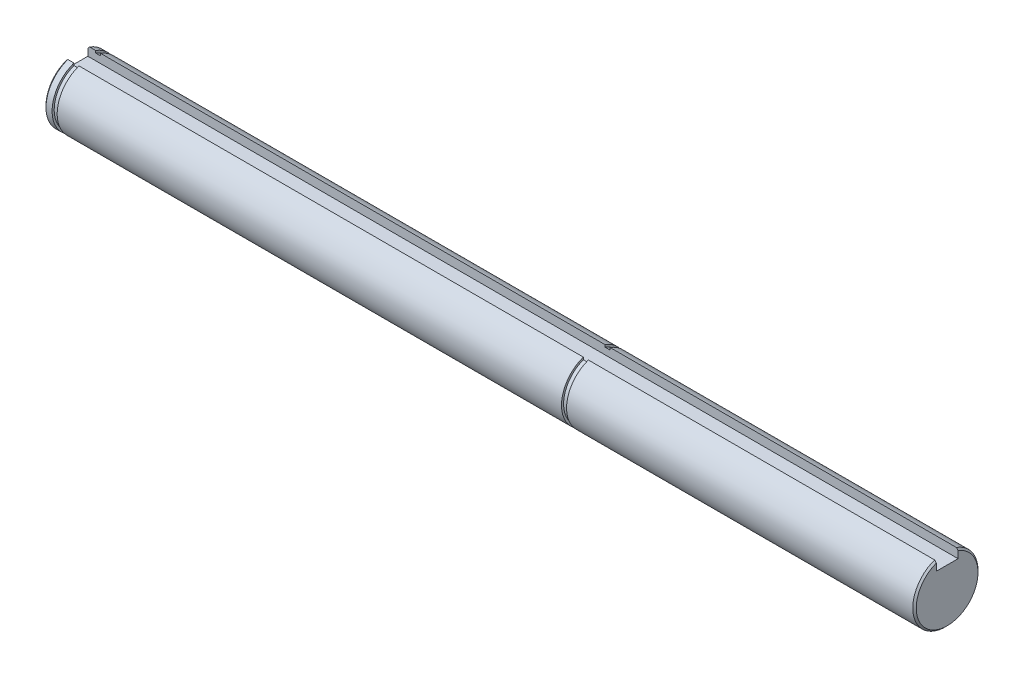
ISO-10303-21;
HEADER;
FILE_DESCRIPTION(('STEP AP214'),'2;1');
FILE_NAME('part.step','',(''),(''),'','','');
FILE_SCHEMA(('AUTOMOTIVE_DESIGN { 1 0 10303 214 1 1 1 1 }'));
ENDSEC;
DATA;
#1=APPLICATION_CONTEXT('core data for automotive mechanical design processes');
#2=APPLICATION_PROTOCOL_DEFINITION('international standard','automotive_design',2000,#1);
#3=PRODUCT_CONTEXT('',#1,'mechanical');
#4=PRODUCT('Part','Part','',(#3));
#5=PRODUCT_RELATED_PRODUCT_CATEGORY('part','',(#4));
#6=PRODUCT_DEFINITION_FORMATION('','',#4);
#7=PRODUCT_DEFINITION_CONTEXT('part definition',#1,'design');
#8=PRODUCT_DEFINITION('design','',#6,#7);
#9=PRODUCT_DEFINITION_SHAPE('','',#8);
#10=(LENGTH_UNIT() NAMED_UNIT(*) SI_UNIT(.MILLI.,.METRE.));
#11=(NAMED_UNIT(*) PLANE_ANGLE_UNIT() SI_UNIT($,.RADIAN.));
#12=(NAMED_UNIT(*) SI_UNIT($,.STERADIAN.) SOLID_ANGLE_UNIT());
#13=UNCERTAINTY_MEASURE_WITH_UNIT(LENGTH_MEASURE(1.E-05),#10,'distance_accuracy_value','');
#14=(GEOMETRIC_REPRESENTATION_CONTEXT(3) GLOBAL_UNCERTAINTY_ASSIGNED_CONTEXT((#13)) GLOBAL_UNIT_ASSIGNED_CONTEXT((#10,
#11,#12)) REPRESENTATION_CONTEXT('',''));
#15=CARTESIAN_POINT('',(0.,0.,0.));
#16=DIRECTION('',(0.,0.,1.));
#17=DIRECTION('',(1.,0.,0.));
#18=AXIS2_PLACEMENT_3D('',#15,#16,#17);
#19=CARTESIAN_POINT('',(659.91194030579,356.657354756465,0.));
#20=DIRECTION('',(1.,0.,0.));
#21=DIRECTION('',(0.,0.,-1.));
#22=AXIS2_PLACEMENT_3D('',#19,#20,#21);
#23=CONICAL_SURFACE('',#22,4.76249999979939,0.785398162502276);
#24=CARTESIAN_POINT('',(659.911940305865,361.151952759526,1.57480000003161));
#25=CARTESIAN_POINT('',(659.869526596549,361.107015509651,1.57480000001581));
#26=CARTESIAN_POINT('',(659.827153075668,361.062040463665,1.57480000000527));
#27=CARTESIAN_POINT('',(659.742486408928,360.972014777503,1.57479999999473));
#28=CARTESIAN_POINT('',(659.700193263073,360.926964137324,1.57479999999473));
#29=CARTESIAN_POINT('',(659.657940305656,360.881875701031,1.5748));
#30=B_SPLINE_CURVE_WITH_KNOTS('',3,(#24,#25,#26,#27,#28,#29),.UNSPECIFIED.,.F.,.F.,(4,2,4),(0.,
0.18537645562414,0.370752919345661),.UNSPECIFIED.);
#31=CARTESIAN_POINT('',(659.911940305823,361.151952759566,1.57479999999999));
#32=VERTEX_POINT('',#31);
#33=CARTESIAN_POINT('',(659.657940305674,360.881875701051,1.5748));
#34=VERTEX_POINT('',#33);
#35=EDGE_CURVE('E126',#32,#34,#30,.T.);
#36=ORIENTED_EDGE('',*,*,#35,.T.);
#37=CARTESIAN_POINT('',(659.657940305692,356.657354756465,0.));
#38=DIRECTION('',(1.,0.,0.));
#39=DIRECTION('',(0.,0.,-1.));
#40=AXIS2_PLACEMENT_3D('',#37,#38,#39);
#41=CIRCLE('',#40,4.50850000015646);
#42=CARTESIAN_POINT('',(659.657940305674,360.872320024559,-1.6002));
#43=VERTEX_POINT('',#42);
#44=EDGE_CURVE('E128',#43,#34,#41,.F.);
#45=ORIENTED_EDGE('',*,*,#44,.F.);
#46=CARTESIAN_POINT('',(659.657940305671,360.872320024525,-1.6001999999729));
#47=CARTESIAN_POINT('',(659.700190128658,360.917507138496,-1.60019999998645));
#48=CARTESIAN_POINT('',(659.742481707333,360.96265506588,-1.60019999999548));
#49=CARTESIAN_POINT('',(659.827148374075,361.052872545361,-1.60020000000452));
#50=CARTESIAN_POINT('',(659.869523462136,361.09794209746,-1.60020000000452));
#51=CARTESIAN_POINT('',(659.911940305883,361.142972462977,-1.6002));
#52=B_SPLINE_CURVE_WITH_KNOTS('',3,(#46,#47,#48,#49,#50,#51),.UNSPECIFIED.,.F.,.F.,(4,2,4),(0.,
0.185586143788459,0.371172278862949),.UNSPECIFIED.);
#53=CARTESIAN_POINT('',(659.911940305877,361.142972463091,-1.6002));
#54=VERTEX_POINT('',#53);
#55=EDGE_CURVE('E21',#43,#54,#52,.T.);
#56=ORIENTED_EDGE('',*,*,#55,.T.);
#57=CARTESIAN_POINT('',(659.911940305764,356.657354756465,0.));
#58=DIRECTION('',(1.,0.,0.));
#59=DIRECTION('',(0.,0.,-1.));
#60=AXIS2_PLACEMENT_3D('',#57,#58,#59);
#61=CIRCLE('',#60,4.7625);
#62=EDGE_CURVE('E164',#32,#54,#61,.T.);
#63=ORIENTED_EDGE('',*,*,#62,.F.);
#64=EDGE_LOOP('',(#36,#45,#56,#63));
#65=FACE_BOUND('',#64,.T.);
#66=ADVANCED_FACE('F17',(#65),#23,.T.);
#67=CARTESIAN_POINT('',(660.229440305764,356.657354756465,0.));
#68=DIRECTION('',(1.,0.,0.));
#69=DIRECTION('',(0.,0.,-1.));
#70=AXIS2_PLACEMENT_3D('',#67,#68,#69);
#71=CYLINDRICAL_SURFACE('',#70,4.7625);
#72=DIRECTION('',(1.,0.,0.));
#73=VECTOR('',#72,1.);
#74=CARTESIAN_POINT('',(660.229440305764,361.151952759623,1.57479999999998));
#75=LINE('',#74,#73);
#76=CARTESIAN_POINT('',(660.800940305764,361.151952759623,1.5748));
#77=VERTEX_POINT('',#76);
#78=EDGE_CURVE('E161',#77,#32,#75,.F.);
#79=ORIENTED_EDGE('',*,*,#78,.T.);
#80=ORIENTED_EDGE('',*,*,#62,.T.);
#81=DIRECTION('',(1.,0.,0.));
#82=VECTOR('',#81,1.);
#83=CARTESIAN_POINT('',(660.229440305764,361.142972463091,-1.6002));
#84=LINE('',#83,#82);
#85=CARTESIAN_POINT('',(660.800940305764,361.142972463091,-1.6002));
#86=VERTEX_POINT('',#85);
#87=EDGE_CURVE('E122',#54,#86,#84,.T.);
#88=ORIENTED_EDGE('',*,*,#87,.T.);
#89=CARTESIAN_POINT('',(660.800940305764,356.657354756465,0.));
#90=DIRECTION('',(1.,0.,0.));
#91=DIRECTION('',(0.,0.,-1.));
#92=AXIS2_PLACEMENT_3D('',#89,#90,#91);
#93=CIRCLE('',#92,4.7625);
#94=EDGE_CURVE('E209',#77,#86,#93,.T.);
#95=ORIENTED_EDGE('',*,*,#94,.F.);
#96=EDGE_LOOP('',(#79,#80,#88,#95));
#97=FACE_BOUND('',#96,.T.);
#98=ADVANCED_FACE('F236',(#97),#71,.T.);
#99=CARTESIAN_POINT('',(786.454740305714,356.657354756465,0.));
#100=DIRECTION('',(-1.,0.,0.));
#101=DIRECTION('',(0.,0.,1.));
#102=AXIS2_PLACEMENT_3D('',#99,#100,#101);
#103=CONICAL_SURFACE('',#102,4.76249999979939,0.78539816239038);
#104=CARTESIAN_POINT('',(786.708740305873,360.881875701034,1.57479999997262));
#105=CARTESIAN_POINT('',(786.666487348461,360.926964137334,1.57479999998631));
#106=CARTESIAN_POINT('',(786.624194202605,360.972014777513,1.57479999999544));
#107=CARTESIAN_POINT('',(786.539527535853,361.062040463666,1.57480000000456));
#108=CARTESIAN_POINT('',(786.49715401496,361.107015509643,1.57480000000456));
#109=CARTESIAN_POINT('',(786.454740305627,361.151952759503,1.5748));
#110=B_SPLINE_CURVE_WITH_KNOTS('',3,(#104,#105,#106,#107,#108,#109),.UNSPECIFIED.,.F.,.F.,(4,2,
4),(0.,0.185376463724679,0.370752919352015),.UNSPECIFIED.);
#111=CARTESIAN_POINT('',(786.708740305879,360.88187570106,1.5748));
#112=VERTEX_POINT('',#111);
#113=CARTESIAN_POINT('',(786.454740305696,361.151952759563,1.5748));
#114=VERTEX_POINT('',#113);
#115=EDGE_CURVE('E149',#112,#114,#110,.T.);
#116=ORIENTED_EDGE('',*,*,#115,.T.);
#117=CARTESIAN_POINT('',(786.454740305764,356.657354756465,0.));
#118=DIRECTION('',(1.,0.,0.));
#119=DIRECTION('',(0.,0.,-1.));
#120=AXIS2_PLACEMENT_3D('',#117,#118,#119);
#121=CIRCLE('',#120,4.7625);
#122=CARTESIAN_POINT('',(786.454740305696,361.142972463031,-1.6002));
#123=VERTEX_POINT('',#122);
#124=EDGE_CURVE('E186',#123,#114,#121,.F.);
#125=ORIENTED_EDGE('',*,*,#124,.F.);
#126=CARTESIAN_POINT('',(786.454740305653,361.142972462995,-1.6002000000453));
#127=CARTESIAN_POINT('',(786.49715714939,361.097942097468,-1.60020000002265));
#128=CARTESIAN_POINT('',(786.539532237448,361.052872545364,-1.60020000000755));
#129=CARTESIAN_POINT('',(786.624198904198,360.962655065889,-1.60019999999245));
#130=CARTESIAN_POINT('',(786.666490482884,360.917507138513,-1.60019999999245));
#131=CARTESIAN_POINT('',(786.708740305889,360.872320024557,-1.6002));
#132=B_SPLINE_CURVE_WITH_KNOTS('',3,(#126,#127,#128,#129,#130,#131),.UNSPECIFIED.,.F.,.F.,(4,2,
4),(0.,0.185586135077501,0.371172278869036),.UNSPECIFIED.);
#133=CARTESIAN_POINT('',(786.708740305827,360.872320024624,-1.6002));
#134=VERTEX_POINT('',#133);
#135=EDGE_CURVE('E190',#123,#134,#132,.T.);
#136=ORIENTED_EDGE('',*,*,#135,.T.);
#137=CARTESIAN_POINT('',(786.708740305869,356.657354756465,0.));
#138=DIRECTION('',(-1.,0.,0.));
#139=DIRECTION('',(0.,0.,1.));
#140=AXIS2_PLACEMENT_3D('',#137,#138,#139);
#141=CIRCLE('',#140,4.50850000015646);
#142=EDGE_CURVE('E213',#112,#134,#141,.F.);
#143=ORIENTED_EDGE('',*,*,#142,.F.);
#144=EDGE_LOOP('',(#116,#125,#136,#143));
#145=FACE_BOUND('',#144,.T.);
#146=ADVANCED_FACE('F231',(#145),#103,.T.);
#147=CARTESIAN_POINT('',(735.908740305764,361.267454756465,0.));
#148=DIRECTION('',(-1.,0.,0.));
#149=DIRECTION('',(0.,0.,1.));
#150=AXIS2_PLACEMENT_3D('',#147,#148,#149);
#151=PLANE('',#150);
#152=DIRECTION('',(0.,1.,0.));
#153=VECTOR('',#152,1.);
#154=CARTESIAN_POINT('',(735.908740305764,361.267454756465,1.5748));
#155=LINE('',#154,#153);
#156=CARTESIAN_POINT('',(735.908740305764,361.151952759623,1.5748));
#157=VERTEX_POINT('',#156);
#158=CARTESIAN_POINT('',(735.908740305764,360.827617847686,1.5748));
#159=VERTEX_POINT('',#158);
#160=EDGE_CURVE('E138',#157,#159,#155,.F.);
#161=ORIENTED_EDGE('',*,*,#160,.T.);
#162=CARTESIAN_POINT('',(735.908740305764,356.657354756465,0.));
#163=DIRECTION('',(1.,0.,0.));
#164=DIRECTION('',(0.,0.,-1.));
#165=AXIS2_PLACEMENT_3D('',#162,#163,#164);
#166=CIRCLE('',#165,4.45770000000003);
#167=CARTESIAN_POINT('',(735.908740305764,360.817937558188,-1.6002));
#168=VERTEX_POINT('',#167);
#169=EDGE_CURVE('E206',#168,#159,#166,.F.);
#170=ORIENTED_EDGE('',*,*,#169,.F.);
#171=DIRECTION('',(0.,1.,0.));
#172=VECTOR('',#171,1.);
#173=CARTESIAN_POINT('',(735.908740305764,361.267454756465,-1.6002));
#174=LINE('',#173,#172);
#175=CARTESIAN_POINT('',(735.908740305764,361.142972463091,-1.6002));
#176=VERTEX_POINT('',#175);
#177=EDGE_CURVE('E140',#168,#176,#174,.T.);
#178=ORIENTED_EDGE('',*,*,#177,.T.);
#179=CARTESIAN_POINT('',(735.908740305764,356.657354756465,0.));
#180=DIRECTION('',(1.,0.,0.));
#181=DIRECTION('',(0.,0.,-1.));
#182=AXIS2_PLACEMENT_3D('',#179,#180,#181);
#183=CIRCLE('',#182,4.7625);
#184=EDGE_CURVE('E183',#157,#176,#183,.T.);
#185=ORIENTED_EDGE('',*,*,#184,.F.);
#186=EDGE_LOOP('',(#161,#170,#178,#185));
#187=FACE_BOUND('',#186,.T.);
#188=ADVANCED_FACE('F235',(#187),#151,.T.);
#189=CARTESIAN_POINT('',(659.657940305764,359.038604756465,0.));
#190=DIRECTION('',(-1.,0.,0.));
#191=DIRECTION('',(0.,0.,1.));
#192=AXIS2_PLACEMENT_3D('',#189,#190,#191);
#193=PLANE('',#192);
#194=DIRECTION('',(0.,1.,0.));
#195=VECTOR('',#194,1.);
#196=CARTESIAN_POINT('',(659.657940305764,359.038604756465,1.5748));
#197=LINE('',#196,#195);
#198=CARTESIAN_POINT('',(659.657940305764,359.845054756465,1.5748));
#199=VERTEX_POINT('',#198);
#200=EDGE_CURVE('E132',#34,#199,#197,.F.);
#201=ORIENTED_EDGE('',*,*,#200,.T.);
#202=DIRECTION('',(0.,0.,-1.));
#203=VECTOR('',#202,1.);
#204=CARTESIAN_POINT('',(659.657940305764,359.845054756465,-1.6002));
#205=LINE('',#204,#203);
#206=CARTESIAN_POINT('',(659.657940305764,359.845054756464,-1.6002));
#207=VERTEX_POINT('',#206);
#208=EDGE_CURVE('E136',#199,#207,#205,.T.);
#209=ORIENTED_EDGE('',*,*,#208,.T.);
#210=DIRECTION('',(0.,1.,0.));
#211=VECTOR('',#210,1.);
#212=CARTESIAN_POINT('',(659.657940305764,359.038604756465,-1.6002));
#213=LINE('',#212,#211);
#214=EDGE_CURVE('E119',#207,#43,#213,.T.);
#215=ORIENTED_EDGE('',*,*,#214,.T.);
#216=ORIENTED_EDGE('',*,*,#44,.T.);
#217=EDGE_LOOP('',(#201,#209,#215,#216));
#218=FACE_BOUND('',#217,.T.);
#219=ADVANCED_FACE('F134',(#218),#193,.T.);
#220=CARTESIAN_POINT('',(786.708740305764,359.038604756465,0.));
#221=DIRECTION('',(1.,0.,0.));
#222=DIRECTION('',(0.,0.,-1.));
#223=AXIS2_PLACEMENT_3D('',#220,#221,#222);
#224=PLANE('',#223);
#225=DIRECTION('',(0.,1.,0.));
#226=VECTOR('',#225,1.);
#227=CARTESIAN_POINT('',(786.708740305764,359.038604756465,1.5748));
#228=LINE('',#227,#226);
#229=CARTESIAN_POINT('',(786.708740305764,359.845054756465,1.5748));
#230=VERTEX_POINT('',#229);
#231=EDGE_CURVE('E216',#230,#112,#228,.T.);
#232=ORIENTED_EDGE('',*,*,#231,.T.);
#233=ORIENTED_EDGE('',*,*,#142,.T.);
#234=DIRECTION('',(0.,1.,0.));
#235=VECTOR('',#234,1.);
#236=CARTESIAN_POINT('',(786.708740305764,359.038604756465,-1.6002));
#237=LINE('',#236,#235);
#238=CARTESIAN_POINT('',(786.708740305764,359.845054756465,-1.6002));
#239=VERTEX_POINT('',#238);
#240=EDGE_CURVE('E278',#134,#239,#237,.F.);
#241=ORIENTED_EDGE('',*,*,#240,.T.);
#242=DIRECTION('',(0.,0.,-1.));
#243=VECTOR('',#242,1.);
#244=CARTESIAN_POINT('',(786.708740305764,359.845054756465,-1.6002));
#245=LINE('',#244,#243);
#246=EDGE_CURVE('E165',#239,#230,#245,.F.);
#247=ORIENTED_EDGE('',*,*,#246,.T.);
#248=EDGE_LOOP('',(#232,#233,#241,#247));
#249=FACE_BOUND('',#248,.T.);
#250=ADVANCED_FACE('F293',(#249),#224,.T.);
#251=CARTESIAN_POINT('',(660.800940305764,361.267454756465,0.));
#252=DIRECTION('',(1.,0.,0.));
#253=DIRECTION('',(0.,0.,-1.));
#254=AXIS2_PLACEMENT_3D('',#251,#252,#253);
#255=PLANE('',#254);
#256=DIRECTION('',(0.,1.,0.));
#257=VECTOR('',#256,1.);
#258=CARTESIAN_POINT('',(660.800940305764,361.267454756465,1.5748));
#259=LINE('',#258,#257);
#260=CARTESIAN_POINT('',(660.800940305764,360.827617847686,1.5748));
#261=VERTEX_POINT('',#260);
#262=EDGE_CURVE('E212',#261,#77,#259,.T.);
#263=ORIENTED_EDGE('',*,*,#262,.T.);
#264=ORIENTED_EDGE('',*,*,#94,.T.);
#265=DIRECTION('',(0.,1.,0.));
#266=VECTOR('',#265,1.);
#267=CARTESIAN_POINT('',(660.800940305764,361.267454756465,-1.6002));
#268=LINE('',#267,#266);
#269=CARTESIAN_POINT('',(660.800940305764,360.817937558188,-1.6002));
#270=VERTEX_POINT('',#269);
#271=EDGE_CURVE('E215',#86,#270,#268,.F.);
#272=ORIENTED_EDGE('',*,*,#271,.T.);
#273=CARTESIAN_POINT('',(660.800940305764,356.657354756465,0.));
#274=DIRECTION('',(1.,0.,0.));
#275=DIRECTION('',(0.,0.,-1.));
#276=AXIS2_PLACEMENT_3D('',#273,#274,#275);
#277=CIRCLE('',#276,4.45770000000003);
#278=EDGE_CURVE('E168',#261,#270,#277,.T.);
#279=ORIENTED_EDGE('',*,*,#278,.F.);
#280=EDGE_LOOP('',(#263,#264,#272,#279));
#281=FACE_BOUND('',#280,.T.);
#282=ADVANCED_FACE('F318',(#281),#255,.T.);
#283=CARTESIAN_POINT('',(735.540440305764,356.657354756465,0.));
#284=DIRECTION('',(1.,0.,0.));
#285=DIRECTION('',(0.,0.,-1.));
#286=AXIS2_PLACEMENT_3D('',#283,#284,#285);
#287=CYLINDRICAL_SURFACE('',#286,4.45770000000003);
#288=DIRECTION('',(1.,0.,0.));
#289=VECTOR('',#288,1.);
#290=CARTESIAN_POINT('',(735.540440305764,360.827617847686,1.57479999999998));
#291=LINE('',#290,#289);
#292=CARTESIAN_POINT('',(735.172140305764,360.827617847686,1.57479999999999));
#293=VERTEX_POINT('',#292);
#294=EDGE_CURVE('E189',#159,#293,#291,.F.);
#295=ORIENTED_EDGE('',*,*,#294,.T.);
#296=CARTESIAN_POINT('',(735.172140305764,356.657354756465,0.));
#297=DIRECTION('',(1.,0.,0.));
#298=DIRECTION('',(0.,0.,-1.));
#299=AXIS2_PLACEMENT_3D('',#296,#297,#298);
#300=CIRCLE('',#299,4.45770000000003);
#301=CARTESIAN_POINT('',(735.172140305764,360.817937558188,-1.6002));
#302=VERTEX_POINT('',#301);
#303=EDGE_CURVE('E154',#302,#293,#300,.F.);
#304=ORIENTED_EDGE('',*,*,#303,.F.);
#305=DIRECTION('',(-1.,0.,0.));
#306=VECTOR('',#305,1.);
#307=CARTESIAN_POINT('',(659.657940305764,360.817937558188,-1.6002));
#308=LINE('',#307,#306);
#309=EDGE_CURVE('E159',#302,#168,#308,.F.);
#310=ORIENTED_EDGE('',*,*,#309,.T.);
#311=ORIENTED_EDGE('',*,*,#169,.T.);
#312=EDGE_LOOP('',(#295,#304,#310,#311));
#313=FACE_BOUND('',#312,.T.);
#314=ADVANCED_FACE('F306',(#313),#287,.T.);
#315=CARTESIAN_POINT('',(761.308740305764,356.657354756465,0.));
#316=DIRECTION('',(1.,0.,0.));
#317=DIRECTION('',(0.,0.,-1.));
#318=AXIS2_PLACEMENT_3D('',#315,#316,#317);
#319=CYLINDRICAL_SURFACE('',#318,4.7625);
#320=DIRECTION('',(1.,0.,0.));
#321=VECTOR('',#320,1.);
#322=CARTESIAN_POINT('',(659.657940305764,361.151952759623,1.5748));
#323=LINE('',#322,#321);
#324=EDGE_CURVE('E150',#114,#157,#323,.F.);
#325=ORIENTED_EDGE('',*,*,#324,.T.);
#326=ORIENTED_EDGE('',*,*,#184,.T.);
#327=DIRECTION('',(-1.,0.,0.));
#328=VECTOR('',#327,1.);
#329=CARTESIAN_POINT('',(659.657940305764,361.142972463091,-1.6002));
#330=LINE('',#329,#328);
#331=EDGE_CURVE('E155',#176,#123,#330,.F.);
#332=ORIENTED_EDGE('',*,*,#331,.T.);
#333=ORIENTED_EDGE('',*,*,#124,.T.);
#334=EDGE_LOOP('',(#325,#326,#332,#333));
#335=FACE_BOUND('',#334,.T.);
#336=ADVANCED_FACE('F299',(#335),#319,.T.);
#337=CARTESIAN_POINT('',(659.657940305764,359.845054756465,-1.6002));
#338=DIRECTION('',(0.,-1.,0.));
#339=DIRECTION('',(0.,0.,-1.));
#340=AXIS2_PLACEMENT_3D('',#337,#338,#339);
#341=PLANE('',#340);
#342=DIRECTION('',(-1.,0.,0.));
#343=VECTOR('',#342,1.);
#344=CARTESIAN_POINT('',(659.657940305764,359.845054756465,-1.6002));
#345=LINE('',#344,#343);
#346=EDGE_CURVE('E158',#239,#207,#345,.T.);
#347=ORIENTED_EDGE('',*,*,#346,.T.);
#348=ORIENTED_EDGE('',*,*,#208,.F.);
#349=DIRECTION('',(1.,0.,0.));
#350=VECTOR('',#349,1.);
#351=CARTESIAN_POINT('',(659.657940305764,359.845054756465,1.5748));
#352=LINE('',#351,#350);
#353=EDGE_CURVE('E171',#199,#230,#352,.T.);
#354=ORIENTED_EDGE('',*,*,#353,.T.);
#355=ORIENTED_EDGE('',*,*,#246,.F.);
#356=EDGE_LOOP('',(#347,#348,#354,#355));
#357=FACE_BOUND('',#356,.T.);
#358=ADVANCED_FACE('F286',(#357),#341,.F.);
#359=CARTESIAN_POINT('',(661.169240305764,356.657354756465,0.));
#360=DIRECTION('',(1.,0.,0.));
#361=DIRECTION('',(0.,0.,-1.));
#362=AXIS2_PLACEMENT_3D('',#359,#360,#361);
#363=CYLINDRICAL_SURFACE('',#362,4.45770000000003);
#364=DIRECTION('',(1.,0.,0.));
#365=VECTOR('',#364,1.);
#366=CARTESIAN_POINT('',(659.657940305764,360.827617847686,1.5748));
#367=LINE('',#366,#365);
#368=CARTESIAN_POINT('',(661.537540305764,360.827617847686,1.5748));
#369=VERTEX_POINT('',#368);
#370=EDGE_CURVE('E175',#369,#261,#367,.F.);
#371=ORIENTED_EDGE('',*,*,#370,.T.);
#372=ORIENTED_EDGE('',*,*,#278,.T.);
#373=DIRECTION('',(-1.,0.,0.));
#374=VECTOR('',#373,1.);
#375=CARTESIAN_POINT('',(659.657940305764,360.817937558188,-1.6002));
#376=LINE('',#375,#374);
#377=CARTESIAN_POINT('',(661.537540305764,360.817937558188,-1.6002));
#378=VERTEX_POINT('',#377);
#379=EDGE_CURVE('E203',#270,#378,#376,.F.);
#380=ORIENTED_EDGE('',*,*,#379,.T.);
#381=CARTESIAN_POINT('',(661.537540305764,356.657354756465,0.));
#382=DIRECTION('',(1.,0.,0.));
#383=DIRECTION('',(0.,0.,-1.));
#384=AXIS2_PLACEMENT_3D('',#381,#382,#383);
#385=CIRCLE('',#384,4.45770000000003);
#386=EDGE_CURVE('E196',#369,#378,#385,.T.);
#387=ORIENTED_EDGE('',*,*,#386,.F.);
#388=EDGE_LOOP('',(#371,#372,#380,#387));
#389=FACE_BOUND('',#388,.T.);
#390=ADVANCED_FACE('F314',(#389),#363,.T.);
#391=CARTESIAN_POINT('',(659.657940305764,363.758944126746,-1.6002));
#392=DIRECTION('',(0.,0.,-1.));
#393=DIRECTION('',(-1.,0.,0.));
#394=AXIS2_PLACEMENT_3D('',#391,#392,#393);
#395=PLANE('',#394);
#396=ORIENTED_EDGE('',*,*,#214,.F.);
#397=ORIENTED_EDGE('',*,*,#346,.F.);
#398=ORIENTED_EDGE('',*,*,#240,.F.);
#399=ORIENTED_EDGE('',*,*,#135,.F.);
#400=ORIENTED_EDGE('',*,*,#331,.F.);
#401=ORIENTED_EDGE('',*,*,#177,.F.);
#402=ORIENTED_EDGE('',*,*,#309,.F.);
#403=DIRECTION('',(0.,1.,0.));
#404=VECTOR('',#403,1.);
#405=CARTESIAN_POINT('',(735.172140305764,361.267454756465,-1.6002));
#406=LINE('',#405,#404);
#407=CARTESIAN_POINT('',(735.172140305764,361.142972463091,-1.6002));
#408=VERTEX_POINT('',#407);
#409=EDGE_CURVE('E179',#408,#302,#406,.F.);
#410=ORIENTED_EDGE('',*,*,#409,.F.);
#411=DIRECTION('',(1.,0.,0.));
#412=VECTOR('',#411,1.);
#413=CARTESIAN_POINT('',(698.354840305764,361.142972463091,-1.6002));
#414=LINE('',#413,#412);
#415=CARTESIAN_POINT('',(661.537540305764,361.142972463091,-1.6002));
#416=VERTEX_POINT('',#415);
#417=EDGE_CURVE('E195',#416,#408,#414,.T.);
#418=ORIENTED_EDGE('',*,*,#417,.F.);
#419=DIRECTION('',(0.,1.,0.));
#420=VECTOR('',#419,1.);
#421=CARTESIAN_POINT('',(661.537540305764,361.267454756465,-1.6002));
#422=LINE('',#421,#420);
#423=EDGE_CURVE('E174',#378,#416,#422,.T.);
#424=ORIENTED_EDGE('',*,*,#423,.F.);
#425=ORIENTED_EDGE('',*,*,#379,.F.);
#426=ORIENTED_EDGE('',*,*,#271,.F.);
#427=ORIENTED_EDGE('',*,*,#87,.F.);
#428=ORIENTED_EDGE('',*,*,#55,.F.);
#429=EDGE_LOOP('',(#396,#397,#398,#399,#400,#401,#402,#410,#418,#424,#425,#426,#427,#428));
#430=FACE_BOUND('',#429,.T.);
#431=ADVANCED_FACE('F116',(#430),#395,.F.);
#432=CARTESIAN_POINT('',(735.172140305764,361.267454756465,0.));
#433=DIRECTION('',(1.,0.,0.));
#434=DIRECTION('',(0.,0.,-1.));
#435=AXIS2_PLACEMENT_3D('',#432,#433,#434);
#436=PLANE('',#435);
#437=DIRECTION('',(0.,1.,0.));
#438=VECTOR('',#437,1.);
#439=CARTESIAN_POINT('',(735.172140305764,359.845054756465,1.5748));
#440=LINE('',#439,#438);
#441=CARTESIAN_POINT('',(735.172140305764,361.151952759623,1.57479999999999));
#442=VERTEX_POINT('',#441);
#443=EDGE_CURVE('E153',#293,#442,#440,.T.);
#444=ORIENTED_EDGE('',*,*,#443,.T.);
#445=CARTESIAN_POINT('',(735.172140305764,356.657354756465,0.));
#446=DIRECTION('',(1.,0.,0.));
#447=DIRECTION('',(0.,0.,-1.));
#448=AXIS2_PLACEMENT_3D('',#445,#446,#447);
#449=CIRCLE('',#448,4.7625);
#450=EDGE_CURVE('E192',#408,#442,#449,.F.);
#451=ORIENTED_EDGE('',*,*,#450,.F.);
#452=ORIENTED_EDGE('',*,*,#409,.T.);
#453=ORIENTED_EDGE('',*,*,#303,.T.);
#454=EDGE_LOOP('',(#444,#451,#452,#453));
#455=FACE_BOUND('',#454,.T.);
#456=ADVANCED_FACE('F308',(#455),#436,.T.);
#457=CARTESIAN_POINT('',(659.657940305764,359.845054756465,1.5748));
#458=DIRECTION('',(0.,0.,1.));
#459=DIRECTION('',(1.,0.,0.));
#460=AXIS2_PLACEMENT_3D('',#457,#458,#459);
#461=PLANE('',#460);
#462=ORIENTED_EDGE('',*,*,#353,.F.);
#463=ORIENTED_EDGE('',*,*,#200,.F.);
#464=ORIENTED_EDGE('',*,*,#35,.F.);
#465=ORIENTED_EDGE('',*,*,#78,.F.);
#466=ORIENTED_EDGE('',*,*,#262,.F.);
#467=ORIENTED_EDGE('',*,*,#370,.F.);
#468=DIRECTION('',(0.,1.,0.));
#469=VECTOR('',#468,1.);
#470=CARTESIAN_POINT('',(661.537540305764,361.267454756465,1.5748));
#471=LINE('',#470,#469);
#472=CARTESIAN_POINT('',(661.537540305764,361.151952759623,1.57479999999999));
#473=VERTEX_POINT('',#472);
#474=EDGE_CURVE('E40',#473,#369,#471,.F.);
#475=ORIENTED_EDGE('',*,*,#474,.F.);
#476=DIRECTION('',(1.,0.,0.));
#477=VECTOR('',#476,1.);
#478=CARTESIAN_POINT('',(698.354840305764,361.151952759623,1.57479999999998));
#479=LINE('',#478,#477);
#480=EDGE_CURVE('E31',#442,#473,#479,.F.);
#481=ORIENTED_EDGE('',*,*,#480,.F.);
#482=ORIENTED_EDGE('',*,*,#443,.F.);
#483=ORIENTED_EDGE('',*,*,#294,.F.);
#484=ORIENTED_EDGE('',*,*,#160,.F.);
#485=ORIENTED_EDGE('',*,*,#324,.F.);
#486=ORIENTED_EDGE('',*,*,#115,.F.);
#487=ORIENTED_EDGE('',*,*,#231,.F.);
#488=EDGE_LOOP('',(#462,#463,#464,#465,#466,#467,#475,#481,#482,#483,#484,#485,#486,#487));
#489=FACE_BOUND('',#488,.T.);
#490=ADVANCED_FACE('F227',(#489),#461,.F.);
#491=CARTESIAN_POINT('',(661.537540305764,361.267454756465,0.));
#492=DIRECTION('',(-1.,0.,0.));
#493=DIRECTION('',(0.,0.,1.));
#494=AXIS2_PLACEMENT_3D('',#491,#492,#493);
#495=PLANE('',#494);
#496=ORIENTED_EDGE('',*,*,#474,.T.);
#497=ORIENTED_EDGE('',*,*,#386,.T.);
#498=ORIENTED_EDGE('',*,*,#423,.T.);
#499=CARTESIAN_POINT('',(661.537540305764,356.657354756465,0.));
#500=DIRECTION('',(1.,0.,0.));
#501=DIRECTION('',(0.,0.,-1.));
#502=AXIS2_PLACEMENT_3D('',#499,#500,#501);
#503=CIRCLE('',#502,4.7625);
#504=EDGE_CURVE('E11',#473,#416,#503,.T.);
#505=ORIENTED_EDGE('',*,*,#504,.F.);
#506=EDGE_LOOP('',(#496,#497,#498,#505));
#507=FACE_BOUND('',#506,.T.);
#508=ADVANCED_FACE('F248',(#507),#495,.T.);
#509=CARTESIAN_POINT('',(698.354840305764,356.657354756465,0.));
#510=DIRECTION('',(1.,0.,0.));
#511=DIRECTION('',(0.,0.,-1.));
#512=AXIS2_PLACEMENT_3D('',#509,#510,#511);
#513=CYLINDRICAL_SURFACE('',#512,4.7625);
#514=ORIENTED_EDGE('',*,*,#480,.T.);
#515=ORIENTED_EDGE('',*,*,#504,.T.);
#516=ORIENTED_EDGE('',*,*,#417,.T.);
#517=ORIENTED_EDGE('',*,*,#450,.T.);
#518=EDGE_LOOP('',(#514,#515,#516,#517));
#519=FACE_BOUND('',#518,.T.);
#520=ADVANCED_FACE('F246',(#519),#513,.T.);
#521=CLOSED_SHELL('',(#66,#98,#146,#188,#219,#250,#282,#314,#336,#358,#390,#431,#456,#490,#508,#520));
#522=MANIFOLD_SOLID_BREP('B1',#521);
#523=ADVANCED_BREP_SHAPE_REPRESENTATION('',(#18,#522),#14);
#524=SHAPE_DEFINITION_REPRESENTATION(#9,#523);
ENDSEC;
END-ISO-10303-21;
